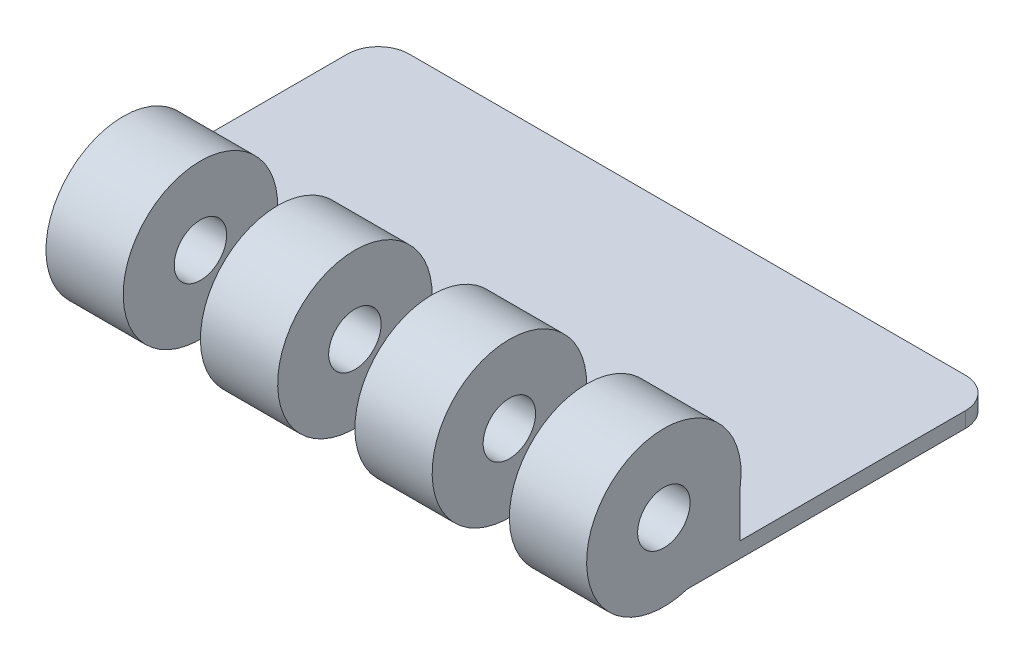
ISO-10303-21;
HEADER;
FILE_DESCRIPTION(('STEP AP214'),'2;1');
FILE_NAME('part.step','',(''),(''),'','','');
FILE_SCHEMA(('AUTOMOTIVE_DESIGN { 1 0 10303 214 1 1 1 1 }'));
ENDSEC;
DATA;
#1=APPLICATION_CONTEXT('core data for automotive mechanical design processes');
#2=APPLICATION_PROTOCOL_DEFINITION('international standard','automotive_design',2000,#1);
#3=PRODUCT_CONTEXT('',#1,'mechanical');
#4=PRODUCT('Part','Part','',(#3));
#5=PRODUCT_RELATED_PRODUCT_CATEGORY('part','',(#4));
#6=PRODUCT_DEFINITION_FORMATION('','',#4);
#7=PRODUCT_DEFINITION_CONTEXT('part definition',#1,'design');
#8=PRODUCT_DEFINITION('design','',#6,#7);
#9=PRODUCT_DEFINITION_SHAPE('','',#8);
#10=(LENGTH_UNIT() NAMED_UNIT(*) SI_UNIT(.MILLI.,.METRE.));
#11=(NAMED_UNIT(*) PLANE_ANGLE_UNIT() SI_UNIT($,.RADIAN.));
#12=(NAMED_UNIT(*) SI_UNIT($,.STERADIAN.) SOLID_ANGLE_UNIT());
#13=UNCERTAINTY_MEASURE_WITH_UNIT(LENGTH_MEASURE(1.E-05),#10,'distance_accuracy_value','');
#14=(GEOMETRIC_REPRESENTATION_CONTEXT(3) GLOBAL_UNCERTAINTY_ASSIGNED_CONTEXT((#13)) GLOBAL_UNIT_ASSIGNED_CONTEXT((#10,
#11,#12)) REPRESENTATION_CONTEXT('',''));
#15=CARTESIAN_POINT('',(0.,0.,0.));
#16=DIRECTION('',(0.,0.,1.));
#17=DIRECTION('',(1.,0.,0.));
#18=AXIS2_PLACEMENT_3D('',#15,#16,#17);
#19=CARTESIAN_POINT('',(-25.4,5.08,12.7));
#20=DIRECTION('',(1.,0.,0.));
#21=DIRECTION('',(0.,0.,-1.));
#22=AXIS2_PLACEMENT_3D('',#19,#20,#21);
#23=PLANE('',#22);
#24=DIRECTION('',(0.,0.,1.));
#25=VECTOR('',#24,1.);
#26=CARTESIAN_POINT('',(-25.4,1.27,-12.7));
#27=LINE('',#26,#25);
#28=CARTESIAN_POINT('',(-25.4,1.27,-10.16));
#29=VERTEX_POINT('',#28);
#30=CARTESIAN_POINT('',(-25.4,1.27,7.62));
#31=VERTEX_POINT('',#30);
#32=EDGE_CURVE('E418',#29,#31,#27,.T.);
#33=ORIENTED_EDGE('',*,*,#32,.F.);
#34=DIRECTION('',(0.,-1.,0.));
#35=VECTOR('',#34,1.);
#36=CARTESIAN_POINT('',(-25.4,5.08,-10.16));
#37=LINE('',#36,#35);
#38=CARTESIAN_POINT('',(-25.4,0.,-10.16));
#39=VERTEX_POINT('',#38);
#40=EDGE_CURVE('E11',#29,#39,#37,.T.);
#41=ORIENTED_EDGE('',*,*,#40,.T.);
#42=DIRECTION('',(0.,0.,1.));
#43=VECTOR('',#42,1.);
#44=CARTESIAN_POINT('',(-25.4,0.,12.7));
#45=LINE('',#44,#43);
#46=CARTESIAN_POINT('',(-25.4,0.,7.62));
#47=VERTEX_POINT('',#46);
#48=EDGE_CURVE('E378',#39,#47,#45,.T.);
#49=ORIENTED_EDGE('',*,*,#48,.T.);
#50=DIRECTION('',(0.,-1.,0.));
#51=VECTOR('',#50,1.);
#52=CARTESIAN_POINT('',(-25.4,5.08,7.62));
#53=LINE('',#52,#51);
#54=EDGE_CURVE('E293',#31,#47,#53,.T.);
#55=ORIENTED_EDGE('',*,*,#54,.F.);
#56=EDGE_LOOP('',(#33,#41,#49,#55));
#57=FACE_BOUND('',#56,.T.);
#58=ADVANCED_FACE('F41',(#57),#23,.F.);
#59=CARTESIAN_POINT('',(25.4,5.08,12.7));
#60=DIRECTION('',(-1.,0.,0.));
#61=DIRECTION('',(0.,0.,1.));
#62=AXIS2_PLACEMENT_3D('',#59,#60,#61);
#63=PLANE('',#62);
#64=CARTESIAN_POINT('',(25.4,6.05164652304968,14.6235577350474));
#65=DIRECTION('',(1.,0.,0.));
#66=DIRECTION('',(0.,0.,-1.));
#67=AXIS2_PLACEMENT_3D('',#64,#65,#66);
#68=CIRCLE('',#67,2.15503395003774);
#69=CARTESIAN_POINT('',(25.4,6.05164652304968,12.4685237850097));
#70=VERTEX_POINT('',#69);
#71=EDGE_CURVE('E250',#70,#70,#68,.T.);
#72=ORIENTED_EDGE('',*,*,#71,.F.);
#73=EDGE_LOOP('',(#72));
#74=FACE_BOUND('',#73,.T.);
#75=DIRECTION('',(0.,0.,-1.));
#76=VECTOR('',#75,1.);
#77=CARTESIAN_POINT('',(25.4,0.,12.7));
#78=LINE('',#77,#76);
#79=CARTESIAN_POINT('',(25.4,0.,12.7));
#80=VERTEX_POINT('',#79);
#81=CARTESIAN_POINT('',(25.4,0.,-10.16));
#82=VERTEX_POINT('',#81);
#83=EDGE_CURVE('E371',#80,#82,#78,.T.);
#84=ORIENTED_EDGE('',*,*,#83,.T.);
#85=DIRECTION('',(0.,-1.,0.));
#86=VECTOR('',#85,1.);
#87=CARTESIAN_POINT('',(25.4,5.08,-10.16));
#88=LINE('',#87,#86);
#89=CARTESIAN_POINT('',(25.4,1.27,-10.16));
#90=VERTEX_POINT('',#89);
#91=EDGE_CURVE('E65',#82,#90,#88,.F.);
#92=ORIENTED_EDGE('',*,*,#91,.T.);
#93=DIRECTION('',(0.,0.,-1.));
#94=VECTOR('',#93,1.);
#95=CARTESIAN_POINT('',(25.4,1.27,8.34833638164118));
#96=LINE('',#95,#94);
#97=CARTESIAN_POINT('',(25.4,1.27,8.34833638164118));
#98=VERTEX_POINT('',#97);
#99=EDGE_CURVE('E410',#98,#90,#96,.T.);
#100=ORIENTED_EDGE('',*,*,#99,.F.);
#101=DIRECTION('',(0.,1.,0.));
#102=VECTOR('',#101,1.);
#103=CARTESIAN_POINT('',(25.4,1.27,8.34833638164118));
#104=LINE('',#103,#102);
#105=CARTESIAN_POINT('',(25.4,5.08,8.34833638164118));
#106=VERTEX_POINT('',#105);
#107=EDGE_CURVE('E428',#98,#106,#104,.T.);
#108=ORIENTED_EDGE('',*,*,#107,.T.);
#109=CARTESIAN_POINT('',(25.4,6.05164652304968,14.6235577350474));
#110=DIRECTION('',(1.,0.,0.));
#111=DIRECTION('',(0.,0.,-1.));
#112=AXIS2_PLACEMENT_3D('',#109,#110,#111);
#113=CIRCLE('',#112,6.35);
#114=EDGE_CURVE('E360',#106,#80,#113,.T.);
#115=ORIENTED_EDGE('',*,*,#114,.T.);
#116=EDGE_LOOP('',(#84,#92,#100,#108,#115));
#117=FACE_BOUND('',#116,.T.);
#118=ADVANCED_FACE('F425',(#74,#117),#63,.F.);
#119=CARTESIAN_POINT('',(-25.4,5.08,-12.7));
#120=DIRECTION('',(0.,0.,1.));
#121=DIRECTION('',(1.,0.,0.));
#122=AXIS2_PLACEMENT_3D('',#119,#120,#121);
#123=PLANE('',#122);
#124=DIRECTION('',(-1.,0.,0.));
#125=VECTOR('',#124,1.);
#126=CARTESIAN_POINT('',(25.4,1.27,-12.7));
#127=LINE('',#126,#125);
#128=CARTESIAN_POINT('',(22.86,1.27,-12.7));
#129=VERTEX_POINT('',#128);
#130=CARTESIAN_POINT('',(-22.86,1.27,-12.7));
#131=VERTEX_POINT('',#130);
#132=EDGE_CURVE('E409',#129,#131,#127,.T.);
#133=ORIENTED_EDGE('',*,*,#132,.F.);
#134=DIRECTION('',(0.,-1.,0.));
#135=VECTOR('',#134,1.);
#136=CARTESIAN_POINT('',(22.86,5.08,-12.7));
#137=LINE('',#136,#135);
#138=CARTESIAN_POINT('',(22.86,0.,-12.7));
#139=VERTEX_POINT('',#138);
#140=EDGE_CURVE('E393',#129,#139,#137,.T.);
#141=ORIENTED_EDGE('',*,*,#140,.T.);
#142=DIRECTION('',(-1.,0.,0.));
#143=VECTOR('',#142,1.);
#144=CARTESIAN_POINT('',(-25.4,0.,-12.7));
#145=LINE('',#144,#143);
#146=CARTESIAN_POINT('',(-22.86,0.,-12.7));
#147=VERTEX_POINT('',#146);
#148=EDGE_CURVE('E374',#139,#147,#145,.T.);
#149=ORIENTED_EDGE('',*,*,#148,.T.);
#150=DIRECTION('',(0.,-1.,0.));
#151=VECTOR('',#150,1.);
#152=CARTESIAN_POINT('',(-22.86,5.08,-12.7));
#153=LINE('',#152,#151);
#154=EDGE_CURVE('E386',#147,#131,#153,.F.);
#155=ORIENTED_EDGE('',*,*,#154,.T.);
#156=EDGE_LOOP('',(#133,#141,#149,#155));
#157=FACE_BOUND('',#156,.T.);
#158=ADVANCED_FACE('F414',(#157),#123,.F.);
#159=CARTESIAN_POINT('',(0.,0.,0.));
#160=DIRECTION('',(0.,-1.,0.));
#161=DIRECTION('',(0.,0.,-1.));
#162=AXIS2_PLACEMENT_3D('',#159,#160,#161);
#163=PLANE('',#162);
#164=ORIENTED_EDGE('',*,*,#148,.F.);
#165=CARTESIAN_POINT('',(22.86,0.,-10.16));
#166=DIRECTION('',(0.,-1.,0.));
#167=DIRECTION('',(0.,0.,-1.));
#168=AXIS2_PLACEMENT_3D('',#165,#166,#167);
#169=CIRCLE('',#168,2.54);
#170=EDGE_CURVE('E400',#139,#82,#169,.T.);
#171=ORIENTED_EDGE('',*,*,#170,.T.);
#172=ORIENTED_EDGE('',*,*,#83,.F.);
#173=DIRECTION('',(1.,0.,0.));
#174=VECTOR('',#173,1.);
#175=CARTESIAN_POINT('',(-25.4,0.,12.7));
#176=LINE('',#175,#174);
#177=CARTESIAN_POINT('',(19.05,0.,12.7));
#178=VERTEX_POINT('',#177);
#179=EDGE_CURVE('E381',#178,#80,#176,.T.);
#180=ORIENTED_EDGE('',*,*,#179,.F.);
#181=DIRECTION('',(0.,0.,1.));
#182=VECTOR('',#181,1.);
#183=CARTESIAN_POINT('',(19.05,0.,7.62));
#184=LINE('',#183,#182);
#185=CARTESIAN_POINT('',(19.05,0.,7.62));
#186=VERTEX_POINT('',#185);
#187=EDGE_CURVE('E247',#186,#178,#184,.T.);
#188=ORIENTED_EDGE('',*,*,#187,.F.);
#189=DIRECTION('',(1.,0.,0.));
#190=VECTOR('',#189,1.);
#191=CARTESIAN_POINT('',(12.7,0.,7.62));
#192=LINE('',#191,#190);
#193=CARTESIAN_POINT('',(12.7,0.,7.62));
#194=VERTEX_POINT('',#193);
#195=EDGE_CURVE('E230',#194,#186,#192,.T.);
#196=ORIENTED_EDGE('',*,*,#195,.F.);
#197=DIRECTION('',(0.,0.,1.));
#198=VECTOR('',#197,1.);
#199=CARTESIAN_POINT('',(12.7,0.,7.62));
#200=LINE('',#199,#198);
#201=CARTESIAN_POINT('',(12.7,0.,12.7));
#202=VERTEX_POINT('',#201);
#203=EDGE_CURVE('E246',#194,#202,#200,.T.);
#204=ORIENTED_EDGE('',*,*,#203,.T.);
#205=CARTESIAN_POINT('',(6.35000000000001,0.,12.7));
#206=VERTEX_POINT('',#205);
#207=EDGE_CURVE('E433',#206,#202,#176,.T.);
#208=ORIENTED_EDGE('',*,*,#207,.F.);
#209=DIRECTION('',(0.,0.,1.));
#210=VECTOR('',#209,1.);
#211=CARTESIAN_POINT('',(6.35000000000001,0.,7.62));
#212=LINE('',#211,#210);
#213=CARTESIAN_POINT('',(6.35000000000001,0.,7.62));
#214=VERTEX_POINT('',#213);
#215=EDGE_CURVE('E234',#214,#206,#212,.T.);
#216=ORIENTED_EDGE('',*,*,#215,.F.);
#217=DIRECTION('',(1.,0.,0.));
#218=VECTOR('',#217,1.);
#219=CARTESIAN_POINT('',(0.,0.,7.62));
#220=LINE('',#219,#218);
#221=CARTESIAN_POINT('',(0.,0.,7.62));
#222=VERTEX_POINT('',#221);
#223=EDGE_CURVE('E261',#222,#214,#220,.T.);
#224=ORIENTED_EDGE('',*,*,#223,.F.);
#225=DIRECTION('',(0.,0.,1.));
#226=VECTOR('',#225,1.);
#227=CARTESIAN_POINT('',(0.,0.,7.62));
#228=LINE('',#227,#226);
#229=CARTESIAN_POINT('',(0.,0.,12.7));
#230=VERTEX_POINT('',#229);
#231=EDGE_CURVE('E239',#222,#230,#228,.T.);
#232=ORIENTED_EDGE('',*,*,#231,.T.);
#233=CARTESIAN_POINT('',(-6.34999999999999,0.,12.7));
#234=VERTEX_POINT('',#233);
#235=EDGE_CURVE('E387',#234,#230,#176,.T.);
#236=ORIENTED_EDGE('',*,*,#235,.F.);
#237=DIRECTION('',(0.,0.,1.));
#238=VECTOR('',#237,1.);
#239=CARTESIAN_POINT('',(-6.34999999999999,0.,7.62));
#240=LINE('',#239,#238);
#241=CARTESIAN_POINT('',(-6.34999999999999,0.,7.62));
#242=VERTEX_POINT('',#241);
#243=EDGE_CURVE('E258',#242,#234,#240,.T.);
#244=ORIENTED_EDGE('',*,*,#243,.F.);
#245=DIRECTION('',(1.,0.,0.));
#246=VECTOR('',#245,1.);
#247=CARTESIAN_POINT('',(-12.7,0.,7.62));
#248=LINE('',#247,#246);
#249=CARTESIAN_POINT('',(-12.7,0.,7.62));
#250=VERTEX_POINT('',#249);
#251=EDGE_CURVE('E275',#250,#242,#248,.T.);
#252=ORIENTED_EDGE('',*,*,#251,.F.);
#253=DIRECTION('',(0.,0.,1.));
#254=VECTOR('',#253,1.);
#255=CARTESIAN_POINT('',(-12.7,0.,7.62));
#256=LINE('',#255,#254);
#257=CARTESIAN_POINT('',(-12.7,0.,12.7));
#258=VERTEX_POINT('',#257);
#259=EDGE_CURVE('E279',#250,#258,#256,.T.);
#260=ORIENTED_EDGE('',*,*,#259,.T.);
#261=CARTESIAN_POINT('',(-19.05,0.,12.7));
#262=VERTEX_POINT('',#261);
#263=EDGE_CURVE('E382',#262,#258,#176,.T.);
#264=ORIENTED_EDGE('',*,*,#263,.F.);
#265=DIRECTION('',(0.,0.,1.));
#266=VECTOR('',#265,1.);
#267=CARTESIAN_POINT('',(-19.05,0.,7.62));
#268=LINE('',#267,#266);
#269=CARTESIAN_POINT('',(-19.05,0.,7.62));
#270=VERTEX_POINT('',#269);
#271=EDGE_CURVE('E272',#270,#262,#268,.T.);
#272=ORIENTED_EDGE('',*,*,#271,.F.);
#273=DIRECTION('',(1.,0.,0.));
#274=VECTOR('',#273,1.);
#275=CARTESIAN_POINT('',(-25.4,0.,7.62));
#276=LINE('',#275,#274);
#277=EDGE_CURVE('E284',#47,#270,#276,.T.);
#278=ORIENTED_EDGE('',*,*,#277,.F.);
#279=ORIENTED_EDGE('',*,*,#48,.F.);
#280=CARTESIAN_POINT('',(-22.86,0.,-10.16));
#281=DIRECTION('',(0.,-1.,0.));
#282=DIRECTION('',(0.,0.,-1.));
#283=AXIS2_PLACEMENT_3D('',#280,#281,#282);
#284=CIRCLE('',#283,2.54);
#285=EDGE_CURVE('E397',#39,#147,#284,.T.);
#286=ORIENTED_EDGE('',*,*,#285,.T.);
#287=EDGE_LOOP('',(#164,#171,#172,#180,#188,#196,#204,#208,#216,#224,#232,#236,#244,#252,#260,
#264,#272,#278,#279,#286));
#288=FACE_BOUND('',#287,.T.);
#289=ADVANCED_FACE('F422',(#288),#163,.T.);
#290=CARTESIAN_POINT('',(19.05,6.05164652304968,14.6235577350474));
#291=DIRECTION('',(1.,0.,0.));
#292=DIRECTION('',(0.,0.,-1.));
#293=AXIS2_PLACEMENT_3D('',#290,#291,#292);
#294=CYLINDRICAL_SURFACE('',#293,6.35);
#295=DIRECTION('',(1.,0.,0.));
#296=VECTOR('',#295,1.);
#297=CARTESIAN_POINT('',(19.05,5.08,8.34833638164118));
#298=LINE('',#297,#296);
#299=CARTESIAN_POINT('',(19.05,5.08,8.34833638164118));
#300=VERTEX_POINT('',#299);
#301=EDGE_CURVE('E365',#300,#106,#298,.T.);
#302=ORIENTED_EDGE('',*,*,#301,.F.);
#303=CARTESIAN_POINT('',(19.05,6.05164652304968,14.6235577350474));
#304=DIRECTION('',(1.,0.,0.));
#305=DIRECTION('',(0.,0.,-1.));
#306=AXIS2_PLACEMENT_3D('',#303,#304,#305);
#307=CIRCLE('',#306,6.35);
#308=EDGE_CURVE('E361',#300,#178,#307,.T.);
#309=ORIENTED_EDGE('',*,*,#308,.T.);
#310=ORIENTED_EDGE('',*,*,#179,.T.);
#311=ORIENTED_EDGE('',*,*,#114,.F.);
#312=EDGE_LOOP('',(#302,#309,#310,#311));
#313=FACE_BOUND('',#312,.T.);
#314=ADVANCED_FACE('F431',(#313),#294,.T.);
#315=CARTESIAN_POINT('',(19.05,6.05164652304968,14.6235577350474));
#316=DIRECTION('',(1.,0.,0.));
#317=DIRECTION('',(0.,0.,-1.));
#318=AXIS2_PLACEMENT_3D('',#315,#316,#317);
#319=PLANE('',#318);
#320=CARTESIAN_POINT('',(19.05,6.05164652304968,14.6235577350474));
#321=DIRECTION('',(1.,0.,0.));
#322=DIRECTION('',(0.,0.,-1.));
#323=AXIS2_PLACEMENT_3D('',#320,#321,#322);
#324=CIRCLE('',#323,2.15503395003774);
#325=CARTESIAN_POINT('',(19.05,6.05164652304968,12.4685237850097));
#326=VERTEX_POINT('',#325);
#327=EDGE_CURVE('E323',#326,#326,#324,.T.);
#328=ORIENTED_EDGE('',*,*,#327,.T.);
#329=EDGE_LOOP('',(#328));
#330=FACE_BOUND('',#329,.T.);
#331=ORIENTED_EDGE('',*,*,#308,.F.);
#332=DIRECTION('',(0.,1.,0.));
#333=VECTOR('',#332,1.);
#334=CARTESIAN_POINT('',(19.05,1.27,8.34833638164118));
#335=LINE('',#334,#333);
#336=CARTESIAN_POINT('',(19.05,1.27,8.34833638164118));
#337=VERTEX_POINT('',#336);
#338=EDGE_CURVE('E224',#337,#300,#335,.T.);
#339=ORIENTED_EDGE('',*,*,#338,.F.);
#340=DIRECTION('',(0.,0.,1.));
#341=VECTOR('',#340,1.);
#342=CARTESIAN_POINT('',(19.05,1.27,7.62));
#343=LINE('',#342,#341);
#344=CARTESIAN_POINT('',(19.05,1.27,7.62));
#345=VERTEX_POINT('',#344);
#346=EDGE_CURVE('E209',#345,#337,#343,.T.);
#347=ORIENTED_EDGE('',*,*,#346,.F.);
#348=DIRECTION('',(0.,1.,0.));
#349=VECTOR('',#348,1.);
#350=CARTESIAN_POINT('',(19.05,0.,7.62));
#351=LINE('',#350,#349);
#352=EDGE_CURVE('E222',#186,#345,#351,.T.);
#353=ORIENTED_EDGE('',*,*,#352,.F.);
#354=ORIENTED_EDGE('',*,*,#187,.T.);
#355=EDGE_LOOP('',(#331,#339,#347,#353,#354));
#356=FACE_BOUND('',#355,.T.);
#357=ADVANCED_FACE('F221',(#330,#356),#319,.F.);
#358=CARTESIAN_POINT('',(6.35000000000001,6.05164652304968,14.6235577350474));
#359=DIRECTION('',(1.,0.,0.));
#360=DIRECTION('',(0.,0.,-1.));
#361=AXIS2_PLACEMENT_3D('',#358,#359,#360);
#362=CYLINDRICAL_SURFACE('',#361,6.35);
#363=DIRECTION('',(1.,0.,0.));
#364=VECTOR('',#363,1.);
#365=CARTESIAN_POINT('',(6.35000000000001,5.08,8.34833638164119));
#366=LINE('',#365,#364);
#367=CARTESIAN_POINT('',(6.35000000000001,5.08,8.34833638164119));
#368=VERTEX_POINT('',#367);
#369=CARTESIAN_POINT('',(12.7,5.08,8.34833638164119));
#370=VERTEX_POINT('',#369);
#371=EDGE_CURVE('E354',#368,#370,#366,.T.);
#372=ORIENTED_EDGE('',*,*,#371,.F.);
#373=CARTESIAN_POINT('',(6.35000000000001,6.05164652304968,14.6235577350474));
#374=DIRECTION('',(1.,0.,0.));
#375=DIRECTION('',(0.,0.,-1.));
#376=AXIS2_PLACEMENT_3D('',#373,#374,#375);
#377=CIRCLE('',#376,6.35);
#378=EDGE_CURVE('E350',#368,#206,#377,.T.);
#379=ORIENTED_EDGE('',*,*,#378,.T.);
#380=ORIENTED_EDGE('',*,*,#207,.T.);
#381=CARTESIAN_POINT('',(12.7,6.05164652304968,14.6235577350474));
#382=DIRECTION('',(1.,0.,0.));
#383=DIRECTION('',(0.,0.,-1.));
#384=AXIS2_PLACEMENT_3D('',#381,#382,#383);
#385=CIRCLE('',#384,6.35);
#386=EDGE_CURVE('E349',#370,#202,#385,.T.);
#387=ORIENTED_EDGE('',*,*,#386,.F.);
#388=EDGE_LOOP('',(#372,#379,#380,#387));
#389=FACE_BOUND('',#388,.T.);
#390=ADVANCED_FACE('F496',(#389),#362,.T.);
#391=CARTESIAN_POINT('',(6.35000000000001,6.05164652304968,14.6235577350474));
#392=DIRECTION('',(1.,0.,0.));
#393=DIRECTION('',(0.,0.,-1.));
#394=AXIS2_PLACEMENT_3D('',#391,#392,#393);
#395=PLANE('',#394);
#396=CARTESIAN_POINT('',(6.35000000000001,6.05164652304968,14.6235577350474));
#397=DIRECTION('',(1.,0.,0.));
#398=DIRECTION('',(0.,0.,-1.));
#399=AXIS2_PLACEMENT_3D('',#396,#397,#398);
#400=CIRCLE('',#399,2.15503395003774);
#401=CARTESIAN_POINT('',(6.35000000000001,6.05164652304968,12.4685237850097));
#402=VERTEX_POINT('',#401);
#403=EDGE_CURVE('E319',#402,#402,#400,.T.);
#404=ORIENTED_EDGE('',*,*,#403,.T.);
#405=EDGE_LOOP('',(#404));
#406=FACE_BOUND('',#405,.T.);
#407=ORIENTED_EDGE('',*,*,#378,.F.);
#408=DIRECTION('',(0.,1.,0.));
#409=VECTOR('',#408,1.);
#410=CARTESIAN_POINT('',(6.35000000000001,1.27,8.34833638164119));
#411=LINE('',#410,#409);
#412=CARTESIAN_POINT('',(6.35000000000001,1.27,8.34833638164119));
#413=VERTEX_POINT('',#412);
#414=EDGE_CURVE('E461',#413,#368,#411,.T.);
#415=ORIENTED_EDGE('',*,*,#414,.F.);
#416=DIRECTION('',(0.,0.,1.));
#417=VECTOR('',#416,1.);
#418=CARTESIAN_POINT('',(6.35000000000001,1.27,7.62));
#419=LINE('',#418,#417);
#420=CARTESIAN_POINT('',(6.35000000000001,1.27,7.62));
#421=VERTEX_POINT('',#420);
#422=EDGE_CURVE('E481',#421,#413,#419,.T.);
#423=ORIENTED_EDGE('',*,*,#422,.F.);
#424=DIRECTION('',(0.,1.,0.));
#425=VECTOR('',#424,1.);
#426=CARTESIAN_POINT('',(6.35000000000001,0.,7.62));
#427=LINE('',#426,#425);
#428=EDGE_CURVE('E253',#214,#421,#427,.T.);
#429=ORIENTED_EDGE('',*,*,#428,.F.);
#430=ORIENTED_EDGE('',*,*,#215,.T.);
#431=EDGE_LOOP('',(#407,#415,#423,#429,#430));
#432=FACE_BOUND('',#431,.T.);
#433=ADVANCED_FACE('F500',(#406,#432),#395,.F.);
#434=CARTESIAN_POINT('',(12.7,6.05164652304968,14.6235577350474));
#435=DIRECTION('',(1.,0.,0.));
#436=DIRECTION('',(0.,0.,-1.));
#437=AXIS2_PLACEMENT_3D('',#434,#435,#436);
#438=PLANE('',#437);
#439=DIRECTION('',(0.,1.,0.));
#440=VECTOR('',#439,1.);
#441=CARTESIAN_POINT('',(12.7,1.27,8.34833638164119));
#442=LINE('',#441,#440);
#443=CARTESIAN_POINT('',(12.7,1.27,8.34833638164119));
#444=VERTEX_POINT('',#443);
#445=EDGE_CURVE('E289',#444,#370,#442,.T.);
#446=ORIENTED_EDGE('',*,*,#445,.T.);
#447=ORIENTED_EDGE('',*,*,#386,.T.);
#448=ORIENTED_EDGE('',*,*,#203,.F.);
#449=DIRECTION('',(0.,-1.,0.));
#450=VECTOR('',#449,1.);
#451=CARTESIAN_POINT('',(12.7,5.08,7.62));
#452=LINE('',#451,#450);
#453=CARTESIAN_POINT('',(12.7,1.27,7.62));
#454=VERTEX_POINT('',#453);
#455=EDGE_CURVE('E233',#454,#194,#452,.T.);
#456=ORIENTED_EDGE('',*,*,#455,.F.);
#457=DIRECTION('',(0.,0.,-1.));
#458=VECTOR('',#457,1.);
#459=CARTESIAN_POINT('',(12.7,1.27,8.34833638164119));
#460=LINE('',#459,#458);
#461=EDGE_CURVE('E213',#444,#454,#460,.T.);
#462=ORIENTED_EDGE('',*,*,#461,.F.);
#463=EDGE_LOOP('',(#446,#447,#448,#456,#462));
#464=FACE_BOUND('',#463,.T.);
#465=CARTESIAN_POINT('',(12.7,6.05164652304968,14.6235577350474));
#466=DIRECTION('',(1.,0.,0.));
#467=DIRECTION('',(0.,0.,-1.));
#468=AXIS2_PLACEMENT_3D('',#465,#466,#467);
#469=CIRCLE('',#468,2.15503395003774);
#470=CARTESIAN_POINT('',(12.7,6.05164652304968,12.4685237850097));
#471=VERTEX_POINT('',#470);
#472=EDGE_CURVE('E315',#471,#471,#469,.T.);
#473=ORIENTED_EDGE('',*,*,#472,.F.);
#474=EDGE_LOOP('',(#473));
#475=FACE_BOUND('',#474,.T.);
#476=ADVANCED_FACE('F491',(#464,#475),#438,.T.);
#477=CARTESIAN_POINT('',(-6.34999999999999,6.05164652304968,14.6235577350474));
#478=DIRECTION('',(1.,0.,0.));
#479=DIRECTION('',(0.,0.,-1.));
#480=AXIS2_PLACEMENT_3D('',#477,#478,#479);
#481=CYLINDRICAL_SURFACE('',#480,6.35);
#482=DIRECTION('',(1.,0.,0.));
#483=VECTOR('',#482,1.);
#484=CARTESIAN_POINT('',(-6.34999999999999,5.08,8.34833638164119));
#485=LINE('',#484,#483);
#486=CARTESIAN_POINT('',(-6.34999999999999,5.08,8.34833638164119));
#487=VERTEX_POINT('',#486);
#488=CARTESIAN_POINT('',(0.,5.08,8.34833638164119));
#489=VERTEX_POINT('',#488);
#490=EDGE_CURVE('E343',#487,#489,#485,.T.);
#491=ORIENTED_EDGE('',*,*,#490,.F.);
#492=CARTESIAN_POINT('',(-6.34999999999999,6.05164652304968,14.6235577350474));
#493=DIRECTION('',(1.,0.,0.));
#494=DIRECTION('',(0.,0.,-1.));
#495=AXIS2_PLACEMENT_3D('',#492,#493,#494);
#496=CIRCLE('',#495,6.35);
#497=EDGE_CURVE('E339',#487,#234,#496,.T.);
#498=ORIENTED_EDGE('',*,*,#497,.T.);
#499=ORIENTED_EDGE('',*,*,#235,.T.);
#500=CARTESIAN_POINT('',(0.,6.05164652304968,14.6235577350474));
#501=DIRECTION('',(1.,0.,0.));
#502=DIRECTION('',(0.,0.,-1.));
#503=AXIS2_PLACEMENT_3D('',#500,#501,#502);
#504=CIRCLE('',#503,6.35);
#505=EDGE_CURVE('E338',#489,#230,#504,.T.);
#506=ORIENTED_EDGE('',*,*,#505,.F.);
#507=EDGE_LOOP('',(#491,#498,#499,#506));
#508=FACE_BOUND('',#507,.T.);
#509=ADVANCED_FACE('F445',(#508),#481,.T.);
#510=CARTESIAN_POINT('',(-6.34999999999999,6.05164652304968,14.6235577350474));
#511=DIRECTION('',(1.,0.,0.));
#512=DIRECTION('',(0.,0.,-1.));
#513=AXIS2_PLACEMENT_3D('',#510,#511,#512);
#514=PLANE('',#513);
#515=CARTESIAN_POINT('',(-6.34999999999999,6.05164652304968,14.6235577350474));
#516=DIRECTION('',(1.,0.,0.));
#517=DIRECTION('',(0.,0.,-1.));
#518=AXIS2_PLACEMENT_3D('',#515,#516,#517);
#519=CIRCLE('',#518,2.15503395003774);
#520=CARTESIAN_POINT('',(-6.34999999999999,6.05164652304968,12.4685237850097));
#521=VERTEX_POINT('',#520);
#522=EDGE_CURVE('E311',#521,#521,#519,.T.);
#523=ORIENTED_EDGE('',*,*,#522,.T.);
#524=EDGE_LOOP('',(#523));
#525=FACE_BOUND('',#524,.T.);
#526=ORIENTED_EDGE('',*,*,#497,.F.);
#527=DIRECTION('',(0.,1.,0.));
#528=VECTOR('',#527,1.);
#529=CARTESIAN_POINT('',(-6.34999999999999,1.27,8.34833638164119));
#530=LINE('',#529,#528);
#531=CARTESIAN_POINT('',(-6.34999999999999,1.27,8.34833638164119));
#532=VERTEX_POINT('',#531);
#533=EDGE_CURVE('E462',#532,#487,#530,.T.);
#534=ORIENTED_EDGE('',*,*,#533,.F.);
#535=DIRECTION('',(0.,0.,1.));
#536=VECTOR('',#535,1.);
#537=CARTESIAN_POINT('',(-6.34999999999999,1.27,7.62));
#538=LINE('',#537,#536);
#539=CARTESIAN_POINT('',(-6.34999999999999,1.27,7.62));
#540=VERTEX_POINT('',#539);
#541=EDGE_CURVE('E513',#540,#532,#538,.T.);
#542=ORIENTED_EDGE('',*,*,#541,.F.);
#543=DIRECTION('',(0.,1.,0.));
#544=VECTOR('',#543,1.);
#545=CARTESIAN_POINT('',(-6.34999999999999,0.,7.62));
#546=LINE('',#545,#544);
#547=EDGE_CURVE('E267',#242,#540,#546,.T.);
#548=ORIENTED_EDGE('',*,*,#547,.F.);
#549=ORIENTED_EDGE('',*,*,#243,.T.);
#550=EDGE_LOOP('',(#526,#534,#542,#548,#549));
#551=FACE_BOUND('',#550,.T.);
#552=ADVANCED_FACE('F603',(#525,#551),#514,.F.);
#553=CARTESIAN_POINT('',(0.,6.05164652304968,14.6235577350474));
#554=DIRECTION('',(1.,0.,0.));
#555=DIRECTION('',(0.,0.,-1.));
#556=AXIS2_PLACEMENT_3D('',#553,#554,#555);
#557=PLANE('',#556);
#558=DIRECTION('',(0.,1.,0.));
#559=VECTOR('',#558,1.);
#560=CARTESIAN_POINT('',(0.,1.27,8.34833638164119));
#561=LINE('',#560,#559);
#562=CARTESIAN_POINT('',(0.,1.27,8.34833638164119));
#563=VERTEX_POINT('',#562);
#564=EDGE_CURVE('E456',#563,#489,#561,.T.);
#565=ORIENTED_EDGE('',*,*,#564,.T.);
#566=ORIENTED_EDGE('',*,*,#505,.T.);
#567=ORIENTED_EDGE('',*,*,#231,.F.);
#568=DIRECTION('',(0.,-1.,0.));
#569=VECTOR('',#568,1.);
#570=CARTESIAN_POINT('',(0.,5.08,7.62));
#571=LINE('',#570,#569);
#572=CARTESIAN_POINT('',(0.,1.27,7.62));
#573=VERTEX_POINT('',#572);
#574=EDGE_CURVE('E257',#573,#222,#571,.T.);
#575=ORIENTED_EDGE('',*,*,#574,.F.);
#576=DIRECTION('',(0.,0.,-1.));
#577=VECTOR('',#576,1.);
#578=CARTESIAN_POINT('',(0.,1.27,8.34833638164119));
#579=LINE('',#578,#577);
#580=EDGE_CURVE('E457',#563,#573,#579,.T.);
#581=ORIENTED_EDGE('',*,*,#580,.F.);
#582=EDGE_LOOP('',(#565,#566,#567,#575,#581));
#583=FACE_BOUND('',#582,.T.);
#584=CARTESIAN_POINT('',(0.,6.05164652304968,14.6235577350474));
#585=DIRECTION('',(1.,0.,0.));
#586=DIRECTION('',(0.,0.,-1.));
#587=AXIS2_PLACEMENT_3D('',#584,#585,#586);
#588=CIRCLE('',#587,2.15503395003774);
#589=CARTESIAN_POINT('',(0.,6.05164652304968,12.4685237850097));
#590=VERTEX_POINT('',#589);
#591=EDGE_CURVE('E307',#590,#590,#588,.T.);
#592=ORIENTED_EDGE('',*,*,#591,.F.);
#593=EDGE_LOOP('',(#592));
#594=FACE_BOUND('',#593,.T.);
#595=ADVANCED_FACE('F451',(#583,#594),#557,.T.);
#596=CARTESIAN_POINT('',(-19.05,6.05164652304968,14.6235577350474));
#597=DIRECTION('',(1.,0.,0.));
#598=DIRECTION('',(0.,0.,-1.));
#599=AXIS2_PLACEMENT_3D('',#596,#597,#598);
#600=CYLINDRICAL_SURFACE('',#599,6.35);
#601=DIRECTION('',(1.,0.,0.));
#602=VECTOR('',#601,1.);
#603=CARTESIAN_POINT('',(-19.05,5.08,8.34833638164119));
#604=LINE('',#603,#602);
#605=CARTESIAN_POINT('',(-19.05,5.08,8.34833638164119));
#606=VERTEX_POINT('',#605);
#607=CARTESIAN_POINT('',(-12.7,5.08,8.34833638164119));
#608=VERTEX_POINT('',#607);
#609=EDGE_CURVE('E332',#606,#608,#604,.T.);
#610=ORIENTED_EDGE('',*,*,#609,.F.);
#611=CARTESIAN_POINT('',(-19.05,6.05164652304968,14.6235577350474));
#612=DIRECTION('',(1.,0.,0.));
#613=DIRECTION('',(0.,0.,-1.));
#614=AXIS2_PLACEMENT_3D('',#611,#612,#613);
#615=CIRCLE('',#614,6.35);
#616=EDGE_CURVE('E328',#606,#262,#615,.T.);
#617=ORIENTED_EDGE('',*,*,#616,.T.);
#618=ORIENTED_EDGE('',*,*,#263,.T.);
#619=CARTESIAN_POINT('',(-12.7,6.05164652304968,14.6235577350474));
#620=DIRECTION('',(1.,0.,0.));
#621=DIRECTION('',(0.,0.,-1.));
#622=AXIS2_PLACEMENT_3D('',#619,#620,#621);
#623=CIRCLE('',#622,6.35);
#624=EDGE_CURVE('E327',#608,#258,#623,.T.);
#625=ORIENTED_EDGE('',*,*,#624,.F.);
#626=EDGE_LOOP('',(#610,#617,#618,#625));
#627=FACE_BOUND('',#626,.T.);
#628=ADVANCED_FACE('F590',(#627),#600,.T.);
#629=CARTESIAN_POINT('',(-19.05,6.05164652304968,14.6235577350474));
#630=DIRECTION('',(1.,0.,0.));
#631=DIRECTION('',(0.,0.,-1.));
#632=AXIS2_PLACEMENT_3D('',#629,#630,#631);
#633=PLANE('',#632);
#634=CARTESIAN_POINT('',(-19.05,6.05164652304968,14.6235577350474));
#635=DIRECTION('',(1.,0.,0.));
#636=DIRECTION('',(0.,0.,-1.));
#637=AXIS2_PLACEMENT_3D('',#634,#635,#636);
#638=CIRCLE('',#637,2.15503395003774);
#639=CARTESIAN_POINT('',(-19.05,6.05164652304968,12.4685237850097));
#640=VERTEX_POINT('',#639);
#641=EDGE_CURVE('E303',#640,#640,#638,.T.);
#642=ORIENTED_EDGE('',*,*,#641,.T.);
#643=EDGE_LOOP('',(#642));
#644=FACE_BOUND('',#643,.T.);
#645=ORIENTED_EDGE('',*,*,#616,.F.);
#646=DIRECTION('',(0.,1.,0.));
#647=VECTOR('',#646,1.);
#648=CARTESIAN_POINT('',(-19.05,1.27,8.34833638164119));
#649=LINE('',#648,#647);
#650=CARTESIAN_POINT('',(-19.05,1.27,8.34833638164119));
#651=VERTEX_POINT('',#650);
#652=EDGE_CURVE('E474',#651,#606,#649,.T.);
#653=ORIENTED_EDGE('',*,*,#652,.F.);
#654=DIRECTION('',(0.,0.,1.));
#655=VECTOR('',#654,1.);
#656=CARTESIAN_POINT('',(-19.05,1.27,7.62));
#657=LINE('',#656,#655);
#658=CARTESIAN_POINT('',(-19.05,1.27,7.62));
#659=VERTEX_POINT('',#658);
#660=EDGE_CURVE('E527',#659,#651,#657,.T.);
#661=ORIENTED_EDGE('',*,*,#660,.F.);
#662=DIRECTION('',(0.,1.,0.));
#663=VECTOR('',#662,1.);
#664=CARTESIAN_POINT('',(-19.05,0.,7.62));
#665=LINE('',#664,#663);
#666=EDGE_CURVE('E288',#270,#659,#665,.T.);
#667=ORIENTED_EDGE('',*,*,#666,.F.);
#668=ORIENTED_EDGE('',*,*,#271,.T.);
#669=EDGE_LOOP('',(#645,#653,#661,#667,#668));
#670=FACE_BOUND('',#669,.T.);
#671=ADVANCED_FACE('F586',(#644,#670),#633,.F.);
#672=CARTESIAN_POINT('',(-12.7,6.05164652304968,14.6235577350474));
#673=DIRECTION('',(1.,0.,0.));
#674=DIRECTION('',(0.,0.,-1.));
#675=AXIS2_PLACEMENT_3D('',#672,#673,#674);
#676=PLANE('',#675);
#677=DIRECTION('',(0.,1.,0.));
#678=VECTOR('',#677,1.);
#679=CARTESIAN_POINT('',(-12.7,1.27,8.34833638164119));
#680=LINE('',#679,#678);
#681=CARTESIAN_POINT('',(-12.7,1.27,8.34833638164119));
#682=VERTEX_POINT('',#681);
#683=EDGE_CURVE('E467',#682,#608,#680,.T.);
#684=ORIENTED_EDGE('',*,*,#683,.T.);
#685=ORIENTED_EDGE('',*,*,#624,.T.);
#686=ORIENTED_EDGE('',*,*,#259,.F.);
#687=DIRECTION('',(0.,-1.,0.));
#688=VECTOR('',#687,1.);
#689=CARTESIAN_POINT('',(-12.7,5.08,7.62));
#690=LINE('',#689,#688);
#691=CARTESIAN_POINT('',(-12.7,1.27,7.62));
#692=VERTEX_POINT('',#691);
#693=EDGE_CURVE('E271',#692,#250,#690,.T.);
#694=ORIENTED_EDGE('',*,*,#693,.F.);
#695=DIRECTION('',(0.,0.,-1.));
#696=VECTOR('',#695,1.);
#697=CARTESIAN_POINT('',(-12.7,1.27,8.34833638164119));
#698=LINE('',#697,#696);
#699=EDGE_CURVE('E520',#682,#692,#698,.T.);
#700=ORIENTED_EDGE('',*,*,#699,.F.);
#701=EDGE_LOOP('',(#684,#685,#686,#694,#700));
#702=FACE_BOUND('',#701,.T.);
#703=CARTESIAN_POINT('',(-12.7,6.05164652304968,14.6235577350474));
#704=DIRECTION('',(1.,0.,0.));
#705=DIRECTION('',(0.,0.,-1.));
#706=AXIS2_PLACEMENT_3D('',#703,#704,#705);
#707=CIRCLE('',#706,2.15503395003774);
#708=CARTESIAN_POINT('',(-12.7,6.05164652304968,12.4685237850097));
#709=VERTEX_POINT('',#708);
#710=EDGE_CURVE('E302',#709,#709,#707,.T.);
#711=ORIENTED_EDGE('',*,*,#710,.F.);
#712=EDGE_LOOP('',(#711));
#713=FACE_BOUND('',#712,.T.);
#714=ADVANCED_FACE('F593',(#702,#713),#676,.T.);
#715=CARTESIAN_POINT('',(-50.8,6.05164652304968,14.6235577350474));
#716=DIRECTION('',(1.,0.,0.));
#717=DIRECTION('',(0.,0.,-1.));
#718=AXIS2_PLACEMENT_3D('',#715,#716,#717);
#719=CYLINDRICAL_SURFACE('',#718,2.15503395003774);
#720=ORIENTED_EDGE('',*,*,#710,.T.);
#721=EDGE_LOOP('',(#720));
#722=FACE_BOUND('',#721,.T.);
#723=ORIENTED_EDGE('',*,*,#641,.F.);
#724=EDGE_LOOP('',(#723));
#725=FACE_BOUND('',#724,.T.);
#726=ADVANCED_FACE('F629',(#722,#725),#719,.F.);
#727=ORIENTED_EDGE('',*,*,#591,.T.);
#728=EDGE_LOOP('',(#727));
#729=FACE_BOUND('',#728,.T.);
#730=ORIENTED_EDGE('',*,*,#522,.F.);
#731=EDGE_LOOP('',(#730));
#732=FACE_BOUND('',#731,.T.);
#733=ADVANCED_FACE('F807',(#729,#732),#719,.F.);
#734=ORIENTED_EDGE('',*,*,#472,.T.);
#735=EDGE_LOOP('',(#734));
#736=FACE_BOUND('',#735,.T.);
#737=ORIENTED_EDGE('',*,*,#403,.F.);
#738=EDGE_LOOP('',(#737));
#739=FACE_BOUND('',#738,.T.);
#740=ADVANCED_FACE('F627',(#736,#739),#719,.F.);
#741=ORIENTED_EDGE('',*,*,#71,.T.);
#742=EDGE_LOOP('',(#741));
#743=FACE_BOUND('',#742,.T.);
#744=ORIENTED_EDGE('',*,*,#327,.F.);
#745=EDGE_LOOP('',(#744));
#746=FACE_BOUND('',#745,.T.);
#747=ADVANCED_FACE('F622',(#743,#746),#719,.F.);
#748=CARTESIAN_POINT('',(0.,0.,7.62));
#749=DIRECTION('',(0.,0.,1.));
#750=DIRECTION('',(1.,0.,0.));
#751=AXIS2_PLACEMENT_3D('',#748,#749,#750);
#752=PLANE('',#751);
#753=DIRECTION('',(1.,0.,0.));
#754=VECTOR('',#753,1.);
#755=CARTESIAN_POINT('',(-12.7,1.27,7.62));
#756=LINE('',#755,#754);
#757=EDGE_CURVE('E517',#692,#540,#756,.T.);
#758=ORIENTED_EDGE('',*,*,#757,.F.);
#759=ORIENTED_EDGE('',*,*,#693,.T.);
#760=ORIENTED_EDGE('',*,*,#251,.T.);
#761=ORIENTED_EDGE('',*,*,#547,.T.);
#762=EDGE_LOOP('',(#758,#759,#760,#761));
#763=FACE_BOUND('',#762,.T.);
#764=ADVANCED_FACE('F601',(#763),#752,.T.);
#765=CARTESIAN_POINT('',(0.,0.,7.62));
#766=DIRECTION('',(0.,0.,1.));
#767=DIRECTION('',(1.,0.,0.));
#768=AXIS2_PLACEMENT_3D('',#765,#766,#767);
#769=PLANE('',#768);
#770=DIRECTION('',(1.,0.,0.));
#771=VECTOR('',#770,1.);
#772=CARTESIAN_POINT('',(-25.4,1.27,7.62));
#773=LINE('',#772,#771);
#774=EDGE_CURVE('E531',#31,#659,#773,.T.);
#775=ORIENTED_EDGE('',*,*,#774,.F.);
#776=ORIENTED_EDGE('',*,*,#54,.T.);
#777=ORIENTED_EDGE('',*,*,#277,.T.);
#778=ORIENTED_EDGE('',*,*,#666,.T.);
#779=EDGE_LOOP('',(#775,#776,#777,#778));
#780=FACE_BOUND('',#779,.T.);
#781=ADVANCED_FACE('F581',(#780),#769,.T.);
#782=CARTESIAN_POINT('',(0.,0.,7.62));
#783=DIRECTION('',(0.,0.,1.));
#784=DIRECTION('',(1.,0.,0.));
#785=AXIS2_PLACEMENT_3D('',#782,#783,#784);
#786=PLANE('',#785);
#787=DIRECTION('',(1.,0.,0.));
#788=VECTOR('',#787,1.);
#789=CARTESIAN_POINT('',(0.,1.27,7.62));
#790=LINE('',#789,#788);
#791=EDGE_CURVE('E485',#573,#421,#790,.T.);
#792=ORIENTED_EDGE('',*,*,#791,.F.);
#793=ORIENTED_EDGE('',*,*,#574,.T.);
#794=ORIENTED_EDGE('',*,*,#223,.T.);
#795=ORIENTED_EDGE('',*,*,#428,.T.);
#796=EDGE_LOOP('',(#792,#793,#794,#795));
#797=FACE_BOUND('',#796,.T.);
#798=ADVANCED_FACE('F505',(#797),#786,.T.);
#799=CARTESIAN_POINT('',(0.,0.,7.62));
#800=DIRECTION('',(0.,0.,1.));
#801=DIRECTION('',(1.,0.,0.));
#802=AXIS2_PLACEMENT_3D('',#799,#800,#801);
#803=PLANE('',#802);
#804=DIRECTION('',(1.,0.,0.));
#805=VECTOR('',#804,1.);
#806=CARTESIAN_POINT('',(12.7,1.27,7.62));
#807=LINE('',#806,#805);
#808=EDGE_CURVE('E205',#454,#345,#807,.T.);
#809=ORIENTED_EDGE('',*,*,#808,.F.);
#810=ORIENTED_EDGE('',*,*,#455,.T.);
#811=ORIENTED_EDGE('',*,*,#195,.T.);
#812=ORIENTED_EDGE('',*,*,#352,.T.);
#813=EDGE_LOOP('',(#809,#810,#811,#812));
#814=FACE_BOUND('',#813,.T.);
#815=ADVANCED_FACE('F228',(#814),#803,.T.);
#816=CARTESIAN_POINT('',(6.35000000000001,1.27,8.34833638164119));
#817=DIRECTION('',(0.,0.,1.));
#818=DIRECTION('',(1.,0.,0.));
#819=AXIS2_PLACEMENT_3D('',#816,#817,#818);
#820=PLANE('',#819);
#821=ORIENTED_EDGE('',*,*,#371,.T.);
#822=ORIENTED_EDGE('',*,*,#445,.F.);
#823=DIRECTION('',(1.,0.,0.));
#824=VECTOR('',#823,1.);
#825=CARTESIAN_POINT('',(6.35000000000001,1.27,8.34833638164119));
#826=LINE('',#825,#824);
#827=EDGE_CURVE('E478',#413,#444,#826,.T.);
#828=ORIENTED_EDGE('',*,*,#827,.F.);
#829=ORIENTED_EDGE('',*,*,#414,.T.);
#830=EDGE_LOOP('',(#821,#822,#828,#829));
#831=FACE_BOUND('',#830,.T.);
#832=ADVANCED_FACE('F606',(#831),#820,.F.);
#833=CARTESIAN_POINT('',(-6.34999999999999,1.27,8.34833638164119));
#834=DIRECTION('',(0.,0.,1.));
#835=DIRECTION('',(1.,0.,0.));
#836=AXIS2_PLACEMENT_3D('',#833,#834,#835);
#837=PLANE('',#836);
#838=ORIENTED_EDGE('',*,*,#490,.T.);
#839=ORIENTED_EDGE('',*,*,#564,.F.);
#840=DIRECTION('',(1.,0.,0.));
#841=VECTOR('',#840,1.);
#842=CARTESIAN_POINT('',(-6.34999999999999,1.27,8.34833638164119));
#843=LINE('',#842,#841);
#844=EDGE_CURVE('E508',#532,#563,#843,.T.);
#845=ORIENTED_EDGE('',*,*,#844,.F.);
#846=ORIENTED_EDGE('',*,*,#533,.T.);
#847=EDGE_LOOP('',(#838,#839,#845,#846));
#848=FACE_BOUND('',#847,.T.);
#849=ADVANCED_FACE('F550',(#848),#837,.F.);
#850=CARTESIAN_POINT('',(-19.05,1.27,8.34833638164119));
#851=DIRECTION('',(0.,0.,1.));
#852=DIRECTION('',(1.,0.,0.));
#853=AXIS2_PLACEMENT_3D('',#850,#851,#852);
#854=PLANE('',#853);
#855=ORIENTED_EDGE('',*,*,#609,.T.);
#856=ORIENTED_EDGE('',*,*,#683,.F.);
#857=DIRECTION('',(1.,0.,0.));
#858=VECTOR('',#857,1.);
#859=CARTESIAN_POINT('',(-19.05,1.27,8.34833638164119));
#860=LINE('',#859,#858);
#861=EDGE_CURVE('E523',#651,#682,#860,.T.);
#862=ORIENTED_EDGE('',*,*,#861,.F.);
#863=ORIENTED_EDGE('',*,*,#652,.T.);
#864=EDGE_LOOP('',(#855,#856,#862,#863));
#865=FACE_BOUND('',#864,.T.);
#866=ADVANCED_FACE('F543',(#865),#854,.F.);
#867=CARTESIAN_POINT('',(19.05,1.27,8.34833638164118));
#868=DIRECTION('',(0.,0.,1.));
#869=DIRECTION('',(1.,0.,0.));
#870=AXIS2_PLACEMENT_3D('',#867,#868,#869);
#871=PLANE('',#870);
#872=ORIENTED_EDGE('',*,*,#301,.T.);
#873=ORIENTED_EDGE('',*,*,#107,.F.);
#874=DIRECTION('',(1.,0.,0.));
#875=VECTOR('',#874,1.);
#876=CARTESIAN_POINT('',(19.05,1.27,8.34833638164118));
#877=LINE('',#876,#875);
#878=EDGE_CURVE('E226',#337,#98,#877,.T.);
#879=ORIENTED_EDGE('',*,*,#878,.F.);
#880=ORIENTED_EDGE('',*,*,#338,.T.);
#881=EDGE_LOOP('',(#872,#873,#879,#880));
#882=FACE_BOUND('',#881,.T.);
#883=ADVANCED_FACE('F541',(#882),#871,.F.);
#884=CARTESIAN_POINT('',(0.,1.27,0.));
#885=DIRECTION('',(0.,-1.,0.));
#886=DIRECTION('',(0.,0.,-1.));
#887=AXIS2_PLACEMENT_3D('',#884,#885,#886);
#888=PLANE('',#887);
#889=ORIENTED_EDGE('',*,*,#99,.T.);
#890=CARTESIAN_POINT('',(22.86,1.27,-10.16));
#891=DIRECTION('',(0.,-1.,0.));
#892=DIRECTION('',(0.,0.,-1.));
#893=AXIS2_PLACEMENT_3D('',#890,#891,#892);
#894=CIRCLE('',#893,2.54);
#895=EDGE_CURVE('E50',#90,#129,#894,.F.);
#896=ORIENTED_EDGE('',*,*,#895,.T.);
#897=ORIENTED_EDGE('',*,*,#132,.T.);
#898=CARTESIAN_POINT('',(-22.86,1.27,-10.16));
#899=DIRECTION('',(0.,-1.,0.));
#900=DIRECTION('',(0.,0.,-1.));
#901=AXIS2_PLACEMENT_3D('',#898,#899,#900);
#902=CIRCLE('',#901,2.54);
#903=EDGE_CURVE('E57',#131,#29,#902,.F.);
#904=ORIENTED_EDGE('',*,*,#903,.T.);
#905=ORIENTED_EDGE('',*,*,#32,.T.);
#906=ORIENTED_EDGE('',*,*,#774,.T.);
#907=ORIENTED_EDGE('',*,*,#660,.T.);
#908=ORIENTED_EDGE('',*,*,#861,.T.);
#909=ORIENTED_EDGE('',*,*,#699,.T.);
#910=ORIENTED_EDGE('',*,*,#757,.T.);
#911=ORIENTED_EDGE('',*,*,#541,.T.);
#912=ORIENTED_EDGE('',*,*,#844,.T.);
#913=ORIENTED_EDGE('',*,*,#580,.T.);
#914=ORIENTED_EDGE('',*,*,#791,.T.);
#915=ORIENTED_EDGE('',*,*,#422,.T.);
#916=ORIENTED_EDGE('',*,*,#827,.T.);
#917=ORIENTED_EDGE('',*,*,#461,.T.);
#918=ORIENTED_EDGE('',*,*,#808,.T.);
#919=ORIENTED_EDGE('',*,*,#346,.T.);
#920=ORIENTED_EDGE('',*,*,#878,.T.);
#921=EDGE_LOOP('',(#889,#896,#897,#904,#905,#906,#907,#908,#909,#910,#911,#912,#913,#914,#915,
#916,#917,#918,#919,#920));
#922=FACE_BOUND('',#921,.T.);
#923=ADVANCED_FACE('F207',(#922),#888,.F.);
#924=CARTESIAN_POINT('',(22.86,5.08,-10.16));
#925=DIRECTION('',(0.,-1.,0.));
#926=DIRECTION('',(0.,0.,-1.));
#927=AXIS2_PLACEMENT_3D('',#924,#925,#926);
#928=CYLINDRICAL_SURFACE('',#927,2.54);
#929=ORIENTED_EDGE('',*,*,#895,.F.);
#930=ORIENTED_EDGE('',*,*,#91,.F.);
#931=ORIENTED_EDGE('',*,*,#170,.F.);
#932=ORIENTED_EDGE('',*,*,#140,.F.);
#933=EDGE_LOOP('',(#929,#930,#931,#932));
#934=FACE_BOUND('',#933,.T.);
#935=ADVANCED_FACE('F420',(#934),#928,.T.);
#936=CARTESIAN_POINT('',(-22.86,5.08,-10.16));
#937=DIRECTION('',(0.,-1.,0.));
#938=DIRECTION('',(0.,0.,-1.));
#939=AXIS2_PLACEMENT_3D('',#936,#937,#938);
#940=CYLINDRICAL_SURFACE('',#939,2.54);
#941=ORIENTED_EDGE('',*,*,#903,.F.);
#942=ORIENTED_EDGE('',*,*,#154,.F.);
#943=ORIENTED_EDGE('',*,*,#285,.F.);
#944=ORIENTED_EDGE('',*,*,#40,.F.);
#945=EDGE_LOOP('',(#941,#942,#943,#944));
#946=FACE_BOUND('',#945,.T.);
#947=ADVANCED_FACE('F43',(#946),#940,.T.);
#948=CLOSED_SHELL('',(#58,#118,#158,#289,#314,#357,#390,#433,#476,#509,#552,#595,#628,#671,#714,
#726,#733,#740,#747,#764,#781,#798,#815,#832,#849,#866,#883,#923,#935,#947));
#949=MANIFOLD_SOLID_BREP('B2',#948);
#950=ADVANCED_BREP_SHAPE_REPRESENTATION('',(#18,#949),#14);
#951=SHAPE_DEFINITION_REPRESENTATION(#9,#950);
ENDSEC;
END-ISO-10303-21;
